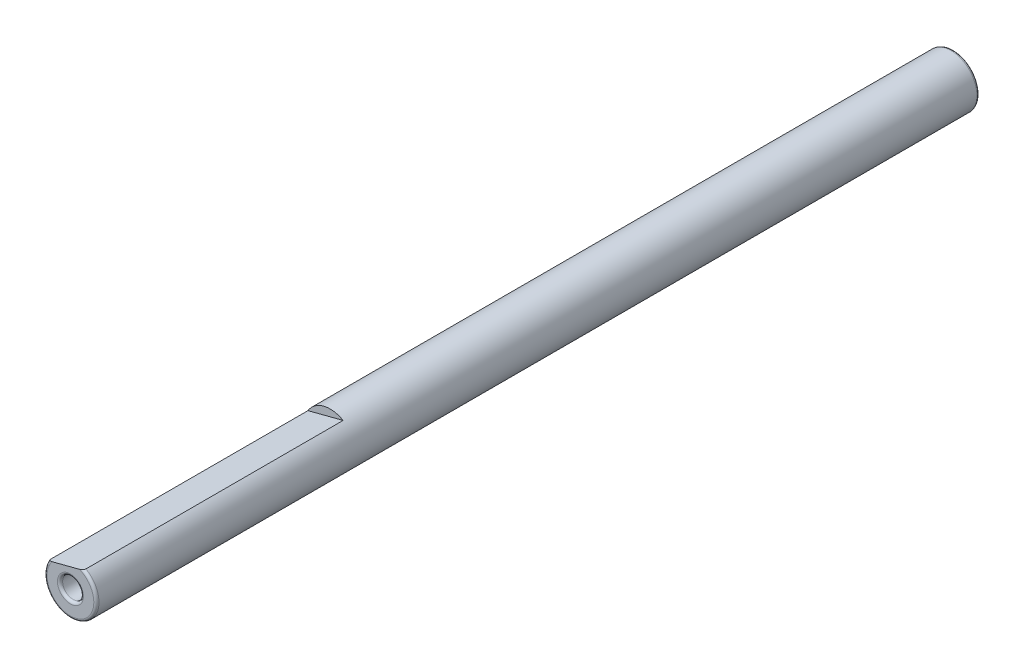
ISO-10303-21;
HEADER;
FILE_DESCRIPTION(('STEP AP214'),'2;1');
FILE_NAME('part.step','',(''),(''),'','','');
FILE_SCHEMA(('AUTOMOTIVE_DESIGN { 1 0 10303 214 1 1 1 1 }'));
ENDSEC;
DATA;
#1=APPLICATION_CONTEXT('core data for automotive mechanical design processes');
#2=APPLICATION_PROTOCOL_DEFINITION('international standard','automotive_design',2000,#1);
#3=PRODUCT_CONTEXT('',#1,'mechanical');
#4=PRODUCT('Part','Part','',(#3));
#5=PRODUCT_RELATED_PRODUCT_CATEGORY('part','',(#4));
#6=PRODUCT_DEFINITION_FORMATION('','',#4);
#7=PRODUCT_DEFINITION_CONTEXT('part definition',#1,'design');
#8=PRODUCT_DEFINITION('design','',#6,#7);
#9=PRODUCT_DEFINITION_SHAPE('','',#8);
#10=(LENGTH_UNIT() NAMED_UNIT(*) SI_UNIT(.MILLI.,.METRE.));
#11=(NAMED_UNIT(*) PLANE_ANGLE_UNIT() SI_UNIT($,.RADIAN.));
#12=(NAMED_UNIT(*) SI_UNIT($,.STERADIAN.) SOLID_ANGLE_UNIT());
#13=UNCERTAINTY_MEASURE_WITH_UNIT(LENGTH_MEASURE(1.E-05),#10,'distance_accuracy_value','');
#14=(GEOMETRIC_REPRESENTATION_CONTEXT(3) GLOBAL_UNCERTAINTY_ASSIGNED_CONTEXT((#13)) GLOBAL_UNIT_ASSIGNED_CONTEXT((#10,
#11,#12)) REPRESENTATION_CONTEXT('',''));
#15=CARTESIAN_POINT('',(0.,0.,0.));
#16=DIRECTION('',(0.,0.,1.));
#17=DIRECTION('',(1.,0.,0.));
#18=AXIS2_PLACEMENT_3D('',#15,#16,#17);
#19=CARTESIAN_POINT('',(0.,0.,85.));
#20=DIRECTION('',(0.,0.,-1.));
#21=DIRECTION('',(-1.,0.,0.));
#22=AXIS2_PLACEMENT_3D('',#19,#20,#21);
#23=CYLINDRICAL_SURFACE('',#22,2.5);
#24=CARTESIAN_POINT('',(0.,0.,84.75));
#25=DIRECTION('',(0.,0.,1.));
#26=DIRECTION('',(1.,0.,0.));
#27=AXIS2_PLACEMENT_3D('',#24,#25,#26);
#28=CIRCLE('',#27,2.5);
#29=CARTESIAN_POINT('',(1.24656963311538,2.16704041258916,84.75));
#30=VERTEX_POINT('',#29);
#31=CARTESIAN_POINT('',(-2.14167556849486,1.28966110250416,84.75));
#32=VERTEX_POINT('',#31);
#33=EDGE_CURVE('E83',#30,#32,#28,.F.);
#34=ORIENTED_EDGE('',*,*,#33,.T.);
#35=DIRECTION('',(0.,0.,1.));
#36=VECTOR('',#35,1.);
#37=CARTESIAN_POINT('',(-2.14167556849486,1.28966110250416,60.));
#38=LINE('',#37,#36);
#39=CARTESIAN_POINT('',(-2.14167556849486,1.28966110250416,60.));
#40=VERTEX_POINT('',#39);
#41=EDGE_CURVE('E53',#40,#32,#38,.T.);
#42=ORIENTED_EDGE('',*,*,#41,.F.);
#43=CARTESIAN_POINT('',(0.,0.,60.));
#44=DIRECTION('',(0.,0.,1.));
#45=DIRECTION('',(1.,0.,0.));
#46=AXIS2_PLACEMENT_3D('',#43,#44,#45);
#47=CIRCLE('',#46,2.5);
#48=CARTESIAN_POINT('',(1.24656963311538,2.16704041258916,60.));
#49=VERTEX_POINT('',#48);
#50=EDGE_CURVE('E71',#49,#40,#47,.T.);
#51=ORIENTED_EDGE('',*,*,#50,.F.);
#52=DIRECTION('',(0.,0.,1.));
#53=VECTOR('',#52,1.);
#54=CARTESIAN_POINT('',(1.24656963311538,2.16704041258916,60.));
#55=LINE('',#54,#53);
#56=EDGE_CURVE('E78',#49,#30,#55,.T.);
#57=ORIENTED_EDGE('',*,*,#56,.T.);
#58=EDGE_LOOP('',(#34,#42,#51,#57));
#59=FACE_BOUND('',#58,.T.);
#60=CARTESIAN_POINT('',(0.,0.,0.25));
#61=DIRECTION('',(0.,0.,1.));
#62=DIRECTION('',(1.,0.,0.));
#63=AXIS2_PLACEMENT_3D('',#60,#61,#62);
#64=CIRCLE('',#63,2.5);
#65=CARTESIAN_POINT('',(2.5,0.,0.25));
#66=VERTEX_POINT('',#65);
#67=EDGE_CURVE('E97',#66,#66,#64,.T.);
#68=ORIENTED_EDGE('',*,*,#67,.T.);
#69=EDGE_LOOP('',(#68));
#70=FACE_BOUND('',#69,.T.);
#71=ADVANCED_FACE('F33',(#59,#70),#23,.T.);
#72=CARTESIAN_POINT('',(0.,0.,85.));
#73=DIRECTION('',(0.,0.,1.));
#74=DIRECTION('',(1.,0.,0.));
#75=AXIS2_PLACEMENT_3D('',#72,#73,#74);
#76=PLANE('',#75);
#77=DIRECTION('',(0.968070057602924,0.250679802881428,0.));
#78=VECTOR('',#77,1.);
#79=CARTESIAN_POINT('',(-2.14167556849486,1.28966110250416,85.));
#80=LINE('',#79,#78);
#81=CARTESIAN_POINT('',(-1.77313748717586,1.38509330067389,85.));
#82=VERTEX_POINT('',#81);
#83=CARTESIAN_POINT('',(0.87803155179638,2.07160821441943,85.));
#84=VERTEX_POINT('',#83);
#85=EDGE_CURVE('E75',#82,#84,#80,.T.);
#86=ORIENTED_EDGE('',*,*,#85,.F.);
#87=CARTESIAN_POINT('',(0.,0.,85.));
#88=DIRECTION('',(0.,0.,1.));
#89=DIRECTION('',(1.,0.,0.));
#90=AXIS2_PLACEMENT_3D('',#87,#88,#89);
#91=CIRCLE('',#90,2.25);
#92=EDGE_CURVE('E94',#82,#84,#91,.T.);
#93=ORIENTED_EDGE('',*,*,#92,.T.);
#94=EDGE_LOOP('',(#86,#93));
#95=FACE_BOUND('',#94,.T.);
#96=CARTESIAN_POINT('',(0.,0.,85.));
#97=DIRECTION('',(0.,0.,1.));
#98=DIRECTION('',(1.,0.,0.));
#99=AXIS2_PLACEMENT_3D('',#96,#97,#98);
#100=CIRCLE('',#99,1.25);
#101=CARTESIAN_POINT('',(1.25,0.,85.));
#102=VERTEX_POINT('',#101);
#103=EDGE_CURVE('E91',#102,#102,#100,.F.);
#104=ORIENTED_EDGE('',*,*,#103,.T.);
#105=EDGE_LOOP('',(#104));
#106=FACE_BOUND('',#105,.T.);
#107=ADVANCED_FACE('F122',(#95,#106),#76,.T.);
#108=CARTESIAN_POINT('',(0.,0.,0.));
#109=DIRECTION('',(0.,0.,1.));
#110=DIRECTION('',(1.,0.,0.));
#111=AXIS2_PLACEMENT_3D('',#108,#109,#110);
#112=PLANE('',#111);
#113=CARTESIAN_POINT('',(0.,0.,0.));
#114=DIRECTION('',(0.,0.,1.));
#115=DIRECTION('',(1.,0.,0.));
#116=AXIS2_PLACEMENT_3D('',#113,#114,#115);
#117=CIRCLE('',#116,2.25);
#118=CARTESIAN_POINT('',(2.25,0.,0.));
#119=VERTEX_POINT('',#118);
#120=EDGE_CURVE('E104',#119,#119,#117,.F.);
#121=ORIENTED_EDGE('',*,*,#120,.T.);
#122=EDGE_LOOP('',(#121));
#123=FACE_BOUND('',#122,.T.);
#124=CARTESIAN_POINT('',(0.,0.,0.));
#125=DIRECTION('',(0.,0.,1.));
#126=DIRECTION('',(1.,0.,0.));
#127=AXIS2_PLACEMENT_3D('',#124,#125,#126);
#128=CIRCLE('',#127,1.);
#129=CARTESIAN_POINT('',(1.,0.,0.));
#130=VERTEX_POINT('',#129);
#131=EDGE_CURVE('E85',#130,#130,#128,.T.);
#132=ORIENTED_EDGE('',*,*,#131,.T.);
#133=EDGE_LOOP('',(#132));
#134=FACE_BOUND('',#133,.T.);
#135=ADVANCED_FACE('F120',(#123,#134),#112,.F.);
#136=CARTESIAN_POINT('',(0.,0.,0.));
#137=DIRECTION('',(0.,0.,1.));
#138=DIRECTION('',(1.,0.,0.));
#139=AXIS2_PLACEMENT_3D('',#136,#137,#138);
#140=CYLINDRICAL_SURFACE('',#139,1.);
#141=CARTESIAN_POINT('',(0.,0.,84.75));
#142=DIRECTION('',(0.,0.,1.));
#143=DIRECTION('',(1.,0.,0.));
#144=AXIS2_PLACEMENT_3D('',#141,#142,#143);
#145=CIRCLE('',#144,1.);
#146=CARTESIAN_POINT('',(1.,0.,84.75));
#147=VERTEX_POINT('',#146);
#148=EDGE_CURVE('E101',#147,#147,#145,.T.);
#149=ORIENTED_EDGE('',*,*,#148,.T.);
#150=EDGE_LOOP('',(#149));
#151=FACE_BOUND('',#150,.T.);
#152=ORIENTED_EDGE('',*,*,#131,.F.);
#153=EDGE_LOOP('',(#152));
#154=FACE_BOUND('',#153,.T.);
#155=ADVANCED_FACE('F116',(#151,#154),#140,.F.);
#156=CARTESIAN_POINT('',(0.,0.,84.75));
#157=DIRECTION('',(0.,0.,1.));
#158=DIRECTION('',(1.,0.,0.));
#159=AXIS2_PLACEMENT_3D('',#156,#157,#158);
#160=TOROIDAL_SURFACE('',#159,2.25,0.25);
#161=CARTESIAN_POINT('',(0.425053761878825,1.95431052279639,84.7498));
#162=CARTESIAN_POINT('',(0.425022132917158,1.95430233254011,84.7568191708284));
#163=CARTESIAN_POINT('',(0.425663766025406,1.95446848214863,84.7638122340751));
#164=CARTESIAN_POINT('',(0.428110624978154,1.95510209137468,84.7774897210039));
#165=CARTESIAN_POINT('',(0.429900948447859,1.95556569205208,84.7841769388553));
#166=CARTESIAN_POINT('',(0.435087518952933,1.9569087440984,84.7989295884776));
#167=CARTESIAN_POINT('',(0.438787022899222,1.95786672323713,84.8068790375475));
#168=CARTESIAN_POINT('',(0.447370133828811,1.9600893026249,84.8220962902687));
#169=CARTESIAN_POINT('',(0.452260267760066,1.96135559301403,84.8293600193247));
#170=CARTESIAN_POINT('',(0.466411005574552,1.96501989823461,84.8478095285237));
#171=CARTESIAN_POINT('',(0.476412152265188,1.96760967514312,84.858382460304));
#172=CARTESIAN_POINT('',(0.497755111910061,1.97313639180444,84.8779326565168));
#173=CARTESIAN_POINT('',(0.509099667963738,1.97607404187736,84.8869065590171));
#174=CARTESIAN_POINT('',(0.543753589675399,1.98504760551103,84.9114391675026));
#175=CARTESIAN_POINT('',(0.56824261872814,1.9913889905456,84.925210853844));
#176=CARTESIAN_POINT('',(0.618834247949331,2.00448959162402,84.9490780861197));
#177=CARTESIAN_POINT('',(0.644941506733713,2.01125001400714,84.9591623814683));
#178=CARTESIAN_POINT('',(0.709640716167357,2.02800374473151,84.9797134317033));
#179=CARTESIAN_POINT('',(0.748752500252955,2.03813166290016,84.9884623523169));
#180=CARTESIAN_POINT('',(0.827804175518326,2.05860193591122,84.999201566197));
#181=CARTESIAN_POINT('',(0.867742736155735,2.06894394621236,85.0012019804268));
#182=CARTESIAN_POINT('',(0.933553221984782,2.08598543973403,84.9980587220651));
#183=CARTESIAN_POINT('',(0.959526473161087,2.09271116111538,84.9951407949997));
#184=CARTESIAN_POINT('',(1.0107922624953,2.10598633460508,84.9854326805404));
#185=CARTESIAN_POINT('',(1.03608594450483,2.11253608291151,84.9786494906682));
#186=CARTESIAN_POINT('',(1.07777015711749,2.12333012629602,84.9632422670608));
#187=CARTESIAN_POINT('',(1.09456021063539,2.12767787703284,84.9557762430456));
#188=CARTESIAN_POINT('',(1.12687777728902,2.13604644620272,84.9383188566183));
#189=CARTESIAN_POINT('',(1.142406952852,2.14006769511799,84.9283308931783));
#190=CARTESIAN_POINT('',(1.16754582153321,2.14657735482306,84.9086403937822));
#191=CARTESIAN_POINT('',(1.17762557139123,2.14918748586436,84.8995808367024));
#192=CARTESIAN_POINT('',(1.19628625750905,2.15401963316704,84.8799320402253));
#193=CARTESIAN_POINT('',(1.20486906917711,2.15624213506163,84.8693447456724));
#194=CARTESIAN_POINT('',(1.21854421977081,2.15978328792374,84.848925051505));
#195=CARTESIAN_POINT('',(1.22399078376004,2.16119366476215,84.8393467472286));
#196=CARTESIAN_POINT('',(1.23327484376571,2.16359775350953,84.8193989029678));
#197=CARTESIAN_POINT('',(1.23711559806018,2.16459230914307,84.8090310161521));
#198=CARTESIAN_POINT('',(1.2421786434389,2.16590337460527,84.7905112509126));
#199=CARTESIAN_POINT('',(1.24382143998123,2.16632877348025,84.7824807397061));
#200=CARTESIAN_POINT('',(1.24602692076251,2.16689987831215,84.7662365219919));
#201=CARTESIAN_POINT('',(1.24658597471944,2.16704464421481,84.7580222926771));
#202=CARTESIAN_POINT('',(1.24656952247878,2.16704038394003,84.7498));
#203=B_SPLINE_CURVE_WITH_KNOTS('',3,(#161,#162,#163,#164,#165,#166,#167,#168,#169,#170,#171,
#172,#173,#174,#175,#176,#177,#178,#179,#180,#181,#182,#183,#184,#185,#186,#187,#188,#189,#190,
#191,#192,#193,#194,#195,#196,#197,#198,#199,#200,#201,#202),.UNSPECIFIED.,.F.,.F.,(4,2,2,2,2,2,
2,2,2,2,2,2,2,2,2,2,2,2,2,2,4),(0.,0.0209811316456926,0.0416954249068607,0.0680081601276865,
0.0944685227141209,0.138565568306266,0.182754260482958,0.268683116398199,0.354872004046447,
0.478305717839832,0.601554231424503,0.682300505968247,0.762901062907967,0.819386018763245,
0.875795248991933,0.917063473857081,0.958279619371743,0.991474295494567,1.02460128698995,
1.04915022391161,1.07378125284237),.UNSPECIFIED.);
#204=EDGE_CURVE('E11',#84,#30,#203,.T.);
#205=ORIENTED_EDGE('',*,*,#204,.F.);
#206=ORIENTED_EDGE('',*,*,#92,.F.);
#207=CARTESIAN_POINT('',(-2.14167545785826,1.28966113115328,84.7498));
#208=CARTESIAN_POINT('',(-2.14171224821897,1.28965160436305,84.7608512320649));
#209=CARTESIAN_POINT('',(-2.1406882898033,1.28991675634434,84.7718778596826));
#210=CARTESIAN_POINT('',(-2.13672949595835,1.29094187808311,84.7934679845931));
#211=CARTESIAN_POINT('',(-2.13381060670334,1.29169771861069,84.8040345684732));
#212=CARTESIAN_POINT('',(-2.12627592797966,1.29364880857819,84.8244598014821));
#213=CARTESIAN_POINT('',(-2.12166433479978,1.29484297139753,84.8343201298147));
#214=CARTESIAN_POINT('',(-2.11102048240825,1.29759917566028,84.8531993834641));
#215=CARTESIAN_POINT('',(-2.10498523707209,1.29916199035466,84.8622164838176));
#216=CARTESIAN_POINT('',(-2.0891899522798,1.30325214772198,84.8826445990604));
#217=CARTESIAN_POINT('',(-2.07889587767031,1.30591777772849,84.8936145679418));
#218=CARTESIAN_POINT('',(-2.05674323972074,1.31165415896546,84.913704852529));
#219=CARTESIAN_POINT('',(-2.04488185384281,1.31472564108644,84.9228217540616));
#220=CARTESIAN_POINT('',(-2.01463923624281,1.32255690635391,84.9429234816592));
#221=CARTESIAN_POINT('',(-1.99567906199685,1.32746660550765,84.9529755173965));
#222=CARTESIAN_POINT('',(-1.95648977092357,1.33761459395555,84.9698986634325));
#223=CARTESIAN_POINT('',(-1.93625851453852,1.3428534372839,84.976764237885));
#224=CARTESIAN_POINT('',(-1.88499761051522,1.35612734573212,84.9904238258284));
#225=CARTESIAN_POINT('',(-1.85354701366388,1.36427141480778,84.9955247727872));
#226=CARTESIAN_POINT('',(-1.79026637803352,1.38065780868645,85.0006140303183));
#227=CARTESIAN_POINT('',(-1.75843570940059,1.38890029658887,85.0005921604285));
#228=CARTESIAN_POINT('',(-1.69375656590205,1.40564883127953,84.9959772907134));
#229=CARTESIAN_POINT('',(-1.66092152783862,1.41415139863476,84.9911922444688));
#230=CARTESIAN_POINT('',(-1.59622233372271,1.43090512539264,84.9770835016307));
#231=CARTESIAN_POINT('',(-1.56435653492472,1.43915671018095,84.9677679983586));
#232=CARTESIAN_POINT('',(-1.51483782482241,1.45197948100203,84.9490673304093));
#233=CARTESIAN_POINT('',(-1.49663274338225,1.45669365038576,84.94122337951));
#234=CARTESIAN_POINT('',(-1.46108703977681,1.46589813915505,84.9235948533831));
#235=CARTESIAN_POINT('',(-1.44374678402905,1.47038836365753,84.9138094641841));
#236=CARTESIAN_POINT('',(-1.41442343807823,1.47798158537227,84.8944774764691));
#237=CARTESIAN_POINT('',(-1.40214106281724,1.48116208185096,84.8854183256589));
#238=CARTESIAN_POINT('',(-1.37891012176449,1.48717768751722,84.8656223205263));
#239=CARTESIAN_POINT('',(-1.36795745382673,1.49001385894728,84.8548908719589));
#240=CARTESIAN_POINT('',(-1.352963863115,1.49389641923781,84.8368992875672));
#241=CARTESIAN_POINT('',(-1.3480949394441,1.4951572172725,84.8303803125725));
#242=CARTESIAN_POINT('',(-1.33924979716044,1.49744764915469,84.8167162472778));
#243=CARTESIAN_POINT('',(-1.33527285515301,1.49847747032379,84.8095716709255));
#244=CARTESIAN_POINT('',(-1.32905451564143,1.50008769688825,84.7958487143419));
#245=CARTESIAN_POINT('',(-1.3266392320052,1.50071312974931,84.7893556231265));
#246=CARTESIAN_POINT('',(-1.32288936105379,1.50168415132316,84.7760518240812));
#247=CARTESIAN_POINT('',(-1.32155183705663,1.50203050048387,84.7692420331865));
#248=CARTESIAN_POINT('',(-1.32037065527532,1.50233636514085,84.7581947002053));
#249=CARTESIAN_POINT('',(-1.32014654500396,1.50239439804685,84.7539976675758));
#250=CARTESIAN_POINT('',(-1.32015969725831,1.50239099229692,84.7498));
#251=B_SPLINE_CURVE_WITH_KNOTS('',3,(#207,#208,#209,#210,#211,#212,#213,#214,#215,#216,#217,
#218,#219,#220,#221,#222,#223,#224,#225,#226,#227,#228,#229,#230,#231,#232,#233,#234,#235,#236,
#237,#238,#239,#240,#241,#242,#243,#244,#245,#246,#247,#248,#249,#250),.UNSPECIFIED.,.F.,.F.,(4,
2,2,2,2,2,2,2,2,2,2,2,2,2,2,2,2,2,2,2,2,4),(0.,0.0330610723724453,0.0658474745302223,
0.0985531407062349,0.13132802708968,0.176907495817816,0.222570195781612,0.28824746892834,
0.354038420136997,0.452159469521612,0.550475514375829,0.652922931865517,0.755185758550748,
0.816233715408757,0.877307321655502,0.923984365944858,0.970513540841106,0.995159236920087,
1.01978487254745,1.04057268476436,1.06130366092345,1.07389006473428),.UNSPECIFIED.);
#252=EDGE_CURVE('E46',#32,#82,#251,.T.);
#253=ORIENTED_EDGE('',*,*,#252,.F.);
#254=ORIENTED_EDGE('',*,*,#33,.F.);
#255=EDGE_LOOP('',(#205,#206,#253,#254));
#256=FACE_BOUND('',#255,.T.);
#257=ADVANCED_FACE('F109',(#256),#160,.T.);
#258=CARTESIAN_POINT('',(0.,0.,84.75));
#259=DIRECTION('',(0.,0.,1.));
#260=DIRECTION('',(1.,0.,0.));
#261=AXIS2_PLACEMENT_3D('',#258,#259,#260);
#262=TOROIDAL_SURFACE('',#261,1.25,0.25);
#263=ORIENTED_EDGE('',*,*,#103,.F.);
#264=EDGE_LOOP('',(#263));
#265=FACE_BOUND('',#264,.T.);
#266=ORIENTED_EDGE('',*,*,#148,.F.);
#267=EDGE_LOOP('',(#266));
#268=FACE_BOUND('',#267,.T.);
#269=ADVANCED_FACE('F151',(#265,#268),#262,.T.);
#270=CARTESIAN_POINT('',(0.,0.,0.25));
#271=DIRECTION('',(0.,0.,1.));
#272=DIRECTION('',(1.,0.,0.));
#273=AXIS2_PLACEMENT_3D('',#270,#271,#272);
#274=TOROIDAL_SURFACE('',#273,2.25,0.25);
#275=ORIENTED_EDGE('',*,*,#120,.F.);
#276=EDGE_LOOP('',(#275));
#277=FACE_BOUND('',#276,.T.);
#278=ORIENTED_EDGE('',*,*,#67,.F.);
#279=EDGE_LOOP('',(#278));
#280=FACE_BOUND('',#279,.T.);
#281=ADVANCED_FACE('F35',(#277,#280),#274,.T.);
#282=CARTESIAN_POINT('',(-2.14167556849486,1.28966110250416,60.));
#283=DIRECTION('',(0.250679802881428,-0.968070057602924,0.));
#284=DIRECTION('',(0.968070057602924,0.250679802881428,0.));
#285=AXIS2_PLACEMENT_3D('',#282,#283,#284);
#286=PLANE('',#285);
#287=ORIENTED_EDGE('',*,*,#204,.T.);
#288=ORIENTED_EDGE('',*,*,#56,.F.);
#289=DIRECTION('',(0.968070057602924,0.250679802881428,0.));
#290=VECTOR('',#289,1.);
#291=CARTESIAN_POINT('',(-2.14167556849486,1.28966110250416,60.));
#292=LINE('',#291,#290);
#293=EDGE_CURVE('E73',#40,#49,#292,.T.);
#294=ORIENTED_EDGE('',*,*,#293,.F.);
#295=ORIENTED_EDGE('',*,*,#41,.T.);
#296=ORIENTED_EDGE('',*,*,#252,.T.);
#297=ORIENTED_EDGE('',*,*,#85,.T.);
#298=EDGE_LOOP('',(#287,#288,#294,#295,#296,#297));
#299=FACE_BOUND('',#298,.T.);
#300=ADVANCED_FACE('F77',(#299),#286,.F.);
#301=CARTESIAN_POINT('',(0.,0.,60.));
#302=DIRECTION('',(0.,0.,1.));
#303=DIRECTION('',(1.,0.,0.));
#304=AXIS2_PLACEMENT_3D('',#301,#302,#303);
#305=PLANE('',#304);
#306=ORIENTED_EDGE('',*,*,#50,.T.);
#307=ORIENTED_EDGE('',*,*,#293,.T.);
#308=EDGE_LOOP('',(#306,#307));
#309=FACE_BOUND('',#308,.T.);
#310=ADVANCED_FACE('F72',(#309),#305,.T.);
#311=CLOSED_SHELL('',(#71,#107,#135,#155,#257,#269,#281,#300,#310));
#312=MANIFOLD_SOLID_BREP('B2',#311);
#313=ADVANCED_BREP_SHAPE_REPRESENTATION('',(#18,#312),#14);
#314=SHAPE_DEFINITION_REPRESENTATION(#9,#313);
ENDSEC;
END-ISO-10303-21;
